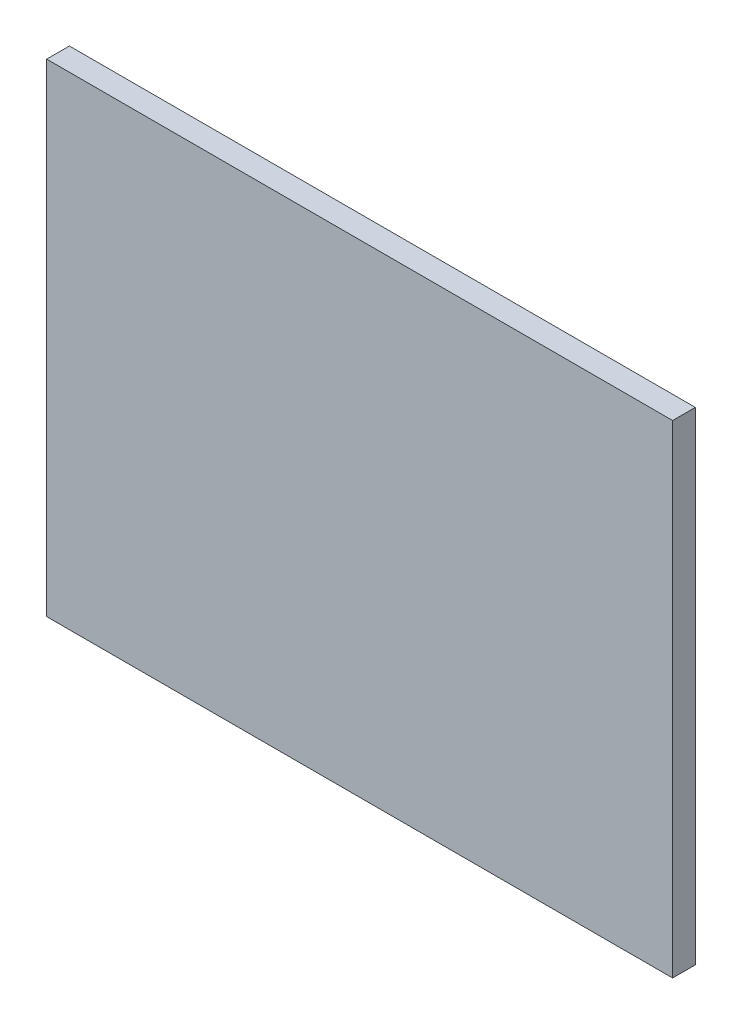
ISO-10303-21;
HEADER;
FILE_DESCRIPTION(('STEP AP214'),'2;1');
FILE_NAME('part.step','',(''),(''),'','','');
FILE_SCHEMA(('AUTOMOTIVE_DESIGN { 1 0 10303 214 1 1 1 1 }'));
ENDSEC;
DATA;
#1=APPLICATION_CONTEXT('core data for automotive mechanical design processes');
#2=APPLICATION_PROTOCOL_DEFINITION('international standard','automotive_design',2000,#1);
#3=PRODUCT_CONTEXT('',#1,'mechanical');
#4=PRODUCT('Part','Part','',(#3));
#5=PRODUCT_RELATED_PRODUCT_CATEGORY('part','',(#4));
#6=PRODUCT_DEFINITION_FORMATION('','',#4);
#7=PRODUCT_DEFINITION_CONTEXT('part definition',#1,'design');
#8=PRODUCT_DEFINITION('design','',#6,#7);
#9=PRODUCT_DEFINITION_SHAPE('','',#8);
#10=(LENGTH_UNIT() NAMED_UNIT(*) SI_UNIT(.MILLI.,.METRE.));
#11=(NAMED_UNIT(*) PLANE_ANGLE_UNIT() SI_UNIT($,.RADIAN.));
#12=(NAMED_UNIT(*) SI_UNIT($,.STERADIAN.) SOLID_ANGLE_UNIT());
#13=UNCERTAINTY_MEASURE_WITH_UNIT(LENGTH_MEASURE(1.E-05),#10,'distance_accuracy_value','');
#14=(GEOMETRIC_REPRESENTATION_CONTEXT(3) GLOBAL_UNCERTAINTY_ASSIGNED_CONTEXT((#13)) GLOBAL_UNIT_ASSIGNED_CONTEXT((#10,
#11,#12)) REPRESENTATION_CONTEXT('',''));
#15=CARTESIAN_POINT('',(0.,0.,0.));
#16=DIRECTION('',(0.,0.,1.));
#17=DIRECTION('',(1.,0.,0.));
#18=AXIS2_PLACEMENT_3D('',#15,#16,#17);
#19=CARTESIAN_POINT('',(43.735,33.735,3.175));
#20=DIRECTION('',(-1.,0.,0.));
#21=DIRECTION('',(0.,-1.,0.));
#22=AXIS2_PLACEMENT_3D('',#19,#20,#21);
#23=PLANE('',#22);
#24=DIRECTION('',(0.,1.,0.));
#25=VECTOR('',#24,1.);
#26=CARTESIAN_POINT('',(43.735,33.735,0.));
#27=LINE('',#26,#25);
#28=CARTESIAN_POINT('',(43.735,-33.735,0.));
#29=VERTEX_POINT('',#28);
#30=CARTESIAN_POINT('',(43.735,33.735,0.));
#31=VERTEX_POINT('',#30);
#32=EDGE_CURVE('E99',#29,#31,#27,.T.);
#33=ORIENTED_EDGE('',*,*,#32,.T.);
#34=DIRECTION('',(0.,0.,-1.));
#35=VECTOR('',#34,1.);
#36=CARTESIAN_POINT('',(43.735,33.735,3.175));
#37=LINE('',#36,#35);
#38=CARTESIAN_POINT('',(43.735,33.735,3.175));
#39=VERTEX_POINT('',#38);
#40=EDGE_CURVE('E11',#39,#31,#37,.T.);
#41=ORIENTED_EDGE('',*,*,#40,.F.);
#42=DIRECTION('',(0.,1.,0.));
#43=VECTOR('',#42,1.);
#44=CARTESIAN_POINT('',(43.735,33.735,3.175));
#45=LINE('',#44,#43);
#46=CARTESIAN_POINT('',(43.735,-33.735,3.175));
#47=VERTEX_POINT('',#46);
#48=EDGE_CURVE('E87',#47,#39,#45,.T.);
#49=ORIENTED_EDGE('',*,*,#48,.F.);
#50=DIRECTION('',(0.,0.,-1.));
#51=VECTOR('',#50,1.);
#52=CARTESIAN_POINT('',(43.735,-33.735,3.175));
#53=LINE('',#52,#51);
#54=EDGE_CURVE('E95',#47,#29,#53,.T.);
#55=ORIENTED_EDGE('',*,*,#54,.T.);
#56=EDGE_LOOP('',(#33,#41,#49,#55));
#57=FACE_BOUND('',#56,.T.);
#58=ADVANCED_FACE('F36',(#57),#23,.F.);
#59=CARTESIAN_POINT('',(-43.735,33.735,3.175));
#60=DIRECTION('',(0.,-1.,0.));
#61=DIRECTION('',(0.,0.,-1.));
#62=AXIS2_PLACEMENT_3D('',#59,#60,#61);
#63=PLANE('',#62);
#64=DIRECTION('',(-1.,0.,0.));
#65=VECTOR('',#64,1.);
#66=CARTESIAN_POINT('',(-43.735,33.735,0.));
#67=LINE('',#66,#65);
#68=CARTESIAN_POINT('',(-43.735,33.735,0.));
#69=VERTEX_POINT('',#68);
#70=EDGE_CURVE('E91',#31,#69,#67,.T.);
#71=ORIENTED_EDGE('',*,*,#70,.T.);
#72=DIRECTION('',(0.,0.,-1.));
#73=VECTOR('',#72,1.);
#74=CARTESIAN_POINT('',(-43.735,33.735,3.175));
#75=LINE('',#74,#73);
#76=CARTESIAN_POINT('',(-43.735,33.735,3.175));
#77=VERTEX_POINT('',#76);
#78=EDGE_CURVE('E44',#77,#69,#75,.T.);
#79=ORIENTED_EDGE('',*,*,#78,.F.);
#80=DIRECTION('',(-1.,0.,0.));
#81=VECTOR('',#80,1.);
#82=CARTESIAN_POINT('',(-43.735,33.735,3.175));
#83=LINE('',#82,#81);
#84=EDGE_CURVE('E82',#39,#77,#83,.T.);
#85=ORIENTED_EDGE('',*,*,#84,.F.);
#86=ORIENTED_EDGE('',*,*,#40,.T.);
#87=EDGE_LOOP('',(#71,#79,#85,#86));
#88=FACE_BOUND('',#87,.T.);
#89=ADVANCED_FACE('F90',(#88),#63,.F.);
#90=CARTESIAN_POINT('',(-43.735,33.735,3.175));
#91=DIRECTION('',(1.,0.,0.));
#92=DIRECTION('',(0.,1.,0.));
#93=AXIS2_PLACEMENT_3D('',#90,#91,#92);
#94=PLANE('',#93);
#95=DIRECTION('',(0.,-1.,0.));
#96=VECTOR('',#95,1.);
#97=CARTESIAN_POINT('',(-43.735,33.735,0.));
#98=LINE('',#97,#96);
#99=CARTESIAN_POINT('',(-43.735,-33.735,0.));
#100=VERTEX_POINT('',#99);
#101=EDGE_CURVE('E69',#69,#100,#98,.T.);
#102=ORIENTED_EDGE('',*,*,#101,.T.);
#103=DIRECTION('',(0.,0.,-1.));
#104=VECTOR('',#103,1.);
#105=CARTESIAN_POINT('',(-43.735,-33.735,3.175));
#106=LINE('',#105,#104);
#107=CARTESIAN_POINT('',(-43.735,-33.735,3.175));
#108=VERTEX_POINT('',#107);
#109=EDGE_CURVE('E92',#108,#100,#106,.T.);
#110=ORIENTED_EDGE('',*,*,#109,.F.);
#111=DIRECTION('',(0.,-1.,0.));
#112=VECTOR('',#111,1.);
#113=CARTESIAN_POINT('',(-43.735,33.735,3.175));
#114=LINE('',#113,#112);
#115=EDGE_CURVE('E85',#77,#108,#114,.T.);
#116=ORIENTED_EDGE('',*,*,#115,.F.);
#117=ORIENTED_EDGE('',*,*,#78,.T.);
#118=EDGE_LOOP('',(#102,#110,#116,#117));
#119=FACE_BOUND('',#118,.T.);
#120=ADVANCED_FACE('F93',(#119),#94,.F.);
#121=CARTESIAN_POINT('',(-43.735,-33.735,3.175));
#122=DIRECTION('',(0.,1.,0.));
#123=DIRECTION('',(0.,0.,1.));
#124=AXIS2_PLACEMENT_3D('',#121,#122,#123);
#125=PLANE('',#124);
#126=DIRECTION('',(1.,0.,0.));
#127=VECTOR('',#126,1.);
#128=CARTESIAN_POINT('',(-43.735,-33.735,0.));
#129=LINE('',#128,#127);
#130=EDGE_CURVE('E75',#100,#29,#129,.T.);
#131=ORIENTED_EDGE('',*,*,#130,.T.);
#132=ORIENTED_EDGE('',*,*,#54,.F.);
#133=DIRECTION('',(1.,0.,0.));
#134=VECTOR('',#133,1.);
#135=CARTESIAN_POINT('',(-43.735,-33.735,3.175));
#136=LINE('',#135,#134);
#137=EDGE_CURVE('E52',#108,#47,#136,.T.);
#138=ORIENTED_EDGE('',*,*,#137,.F.);
#139=ORIENTED_EDGE('',*,*,#109,.T.);
#140=EDGE_LOOP('',(#131,#132,#138,#139));
#141=FACE_BOUND('',#140,.T.);
#142=ADVANCED_FACE('F106',(#141),#125,.F.);
#143=CARTESIAN_POINT('',(0.,0.,3.175));
#144=DIRECTION('',(0.,0.,1.));
#145=DIRECTION('',(1.,0.,0.));
#146=AXIS2_PLACEMENT_3D('',#143,#144,#145);
#147=PLANE('',#146);
#148=ORIENTED_EDGE('',*,*,#48,.T.);
#149=ORIENTED_EDGE('',*,*,#84,.T.);
#150=ORIENTED_EDGE('',*,*,#115,.T.);
#151=ORIENTED_EDGE('',*,*,#137,.T.);
#152=EDGE_LOOP('',(#148,#149,#150,#151));
#153=FACE_BOUND('',#152,.T.);
#154=ADVANCED_FACE('F83',(#153),#147,.T.);
#155=CARTESIAN_POINT('',(0.,0.,0.));
#156=DIRECTION('',(0.,0.,1.));
#157=DIRECTION('',(1.,0.,0.));
#158=AXIS2_PLACEMENT_3D('',#155,#156,#157);
#159=PLANE('',#158);
#160=ORIENTED_EDGE('',*,*,#32,.F.);
#161=ORIENTED_EDGE('',*,*,#130,.F.);
#162=ORIENTED_EDGE('',*,*,#101,.F.);
#163=ORIENTED_EDGE('',*,*,#70,.F.);
#164=EDGE_LOOP('',(#160,#161,#162,#163));
#165=FACE_BOUND('',#164,.T.);
#166=ADVANCED_FACE('F109',(#165),#159,.F.);
#167=CLOSED_SHELL('',(#58,#89,#120,#142,#154,#166));
#168=MANIFOLD_SOLID_BREP('B2',#167);
#169=ADVANCED_BREP_SHAPE_REPRESENTATION('',(#18,#168),#14);
#170=SHAPE_DEFINITION_REPRESENTATION(#9,#169);
ENDSEC;
END-ISO-10303-21;
